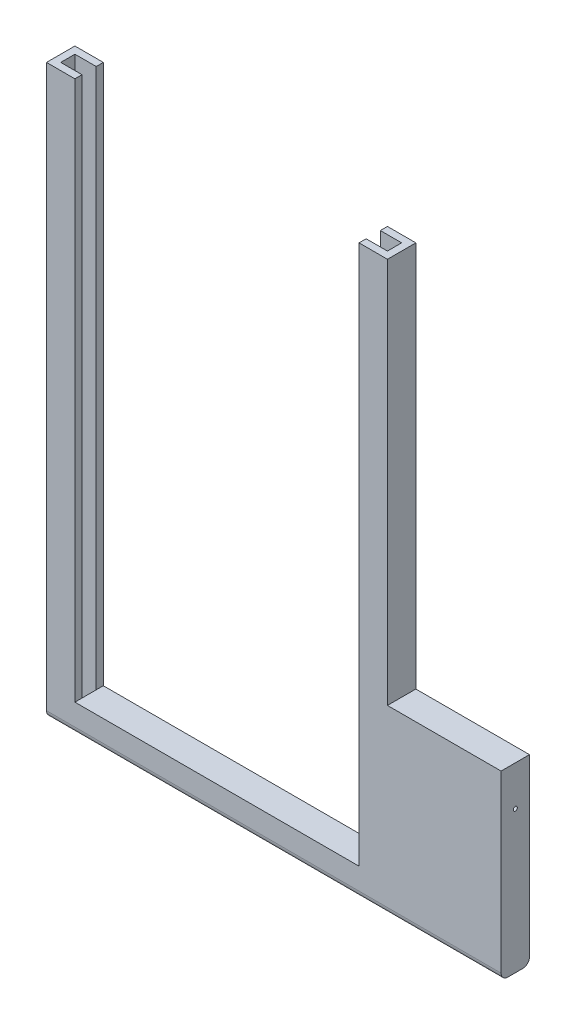
ISO-10303-21;
HEADER;
FILE_DESCRIPTION(('STEP AP214'),'2;1');
FILE_NAME('part.step','',(''),(''),'','','');
FILE_SCHEMA(('AUTOMOTIVE_DESIGN { 1 0 10303 214 1 1 1 1 }'));
ENDSEC;
DATA;
#1=APPLICATION_CONTEXT('core data for automotive mechanical design processes');
#2=APPLICATION_PROTOCOL_DEFINITION('international standard','automotive_design',2000,#1);
#3=PRODUCT_CONTEXT('',#1,'mechanical');
#4=PRODUCT('Part','Part','',(#3));
#5=PRODUCT_RELATED_PRODUCT_CATEGORY('part','',(#4));
#6=PRODUCT_DEFINITION_FORMATION('','',#4);
#7=PRODUCT_DEFINITION_CONTEXT('part definition',#1,'design');
#8=PRODUCT_DEFINITION('design','',#6,#7);
#9=PRODUCT_DEFINITION_SHAPE('','',#8);
#10=(LENGTH_UNIT() NAMED_UNIT(*) SI_UNIT(.MILLI.,.METRE.));
#11=(NAMED_UNIT(*) PLANE_ANGLE_UNIT() SI_UNIT($,.RADIAN.));
#12=(NAMED_UNIT(*) SI_UNIT($,.STERADIAN.) SOLID_ANGLE_UNIT());
#13=UNCERTAINTY_MEASURE_WITH_UNIT(LENGTH_MEASURE(1.E-05),#10,'distance_accuracy_value','');
#14=(GEOMETRIC_REPRESENTATION_CONTEXT(3) GLOBAL_UNCERTAINTY_ASSIGNED_CONTEXT((#13)) GLOBAL_UNIT_ASSIGNED_CONTEXT((#10,
#11,#12)) REPRESENTATION_CONTEXT('',''));
#15=CARTESIAN_POINT('',(0.,0.,0.));
#16=DIRECTION('',(0.,0.,1.));
#17=DIRECTION('',(1.,0.,0.));
#18=AXIS2_PLACEMENT_3D('',#15,#16,#17);
#19=CARTESIAN_POINT('',(55.,4.99999999999999,5.));
#20=DIRECTION('',(1.,0.,0.));
#21=DIRECTION('',(0.,0.,-1.));
#22=AXIS2_PLACEMENT_3D('',#19,#20,#21);
#23=PLANE('',#22);
#24=DIRECTION('',(0.,0.,-1.));
#25=VECTOR('',#24,1.);
#26=CARTESIAN_POINT('',(55.,100.,5.));
#27=LINE('',#26,#25);
#28=CARTESIAN_POINT('',(55.,100.,5.));
#29=VERTEX_POINT('',#28);
#30=CARTESIAN_POINT('',(55.,100.,3.75));
#31=VERTEX_POINT('',#30);
#32=EDGE_CURVE('E375',#29,#31,#27,.T.);
#33=ORIENTED_EDGE('',*,*,#32,.T.);
#34=DIRECTION('',(0.,1.,0.));
#35=VECTOR('',#34,1.);
#36=CARTESIAN_POINT('',(55.,0.,3.75));
#37=LINE('',#36,#35);
#38=CARTESIAN_POINT('',(55.,4.99999999999999,3.75));
#39=VERTEX_POINT('',#38);
#40=EDGE_CURVE('E238',#39,#31,#37,.T.);
#41=ORIENTED_EDGE('',*,*,#40,.F.);
#42=DIRECTION('',(0.,0.,-1.));
#43=VECTOR('',#42,1.);
#44=CARTESIAN_POINT('',(55.,4.99999999999999,5.));
#45=LINE('',#44,#43);
#46=CARTESIAN_POINT('',(55.,4.99999999999999,5.));
#47=VERTEX_POINT('',#46);
#48=EDGE_CURVE('E369',#47,#39,#45,.T.);
#49=ORIENTED_EDGE('',*,*,#48,.F.);
#50=DIRECTION('',(0.,-1.,0.));
#51=VECTOR('',#50,1.);
#52=CARTESIAN_POINT('',(55.,4.99999999999999,5.));
#53=LINE('',#52,#51);
#54=EDGE_CURVE('E304',#29,#47,#53,.T.);
#55=ORIENTED_EDGE('',*,*,#54,.F.);
#56=EDGE_LOOP('',(#33,#41,#49,#55));
#57=FACE_BOUND('',#56,.T.);
#58=ADVANCED_FACE('F39',(#57),#23,.F.);
#59=CARTESIAN_POINT('',(5.,100.,5.));
#60=DIRECTION('',(-1.,0.,0.));
#61=DIRECTION('',(0.,-1.,0.));
#62=AXIS2_PLACEMENT_3D('',#59,#60,#61);
#63=PLANE('',#62);
#64=DIRECTION('',(0.,0.,-1.));
#65=VECTOR('',#64,1.);
#66=CARTESIAN_POINT('',(5.00000000000001,4.99999999999999,5.));
#67=LINE('',#66,#65);
#68=CARTESIAN_POINT('',(5.00000000000001,4.99999999999999,5.));
#69=VERTEX_POINT('',#68);
#70=CARTESIAN_POINT('',(5.,4.99999999999999,3.75));
#71=VERTEX_POINT('',#70);
#72=EDGE_CURVE('E364',#69,#71,#67,.T.);
#73=ORIENTED_EDGE('',*,*,#72,.T.);
#74=DIRECTION('',(0.,1.,0.));
#75=VECTOR('',#74,1.);
#76=CARTESIAN_POINT('',(5.,0.,3.75));
#77=LINE('',#76,#75);
#78=CARTESIAN_POINT('',(5.,100.,3.75));
#79=VERTEX_POINT('',#78);
#80=EDGE_CURVE('E262',#71,#79,#77,.T.);
#81=ORIENTED_EDGE('',*,*,#80,.T.);
#82=DIRECTION('',(0.,0.,-1.));
#83=VECTOR('',#82,1.);
#84=CARTESIAN_POINT('',(5.,100.,5.));
#85=LINE('',#84,#83);
#86=CARTESIAN_POINT('',(5.,100.,5.));
#87=VERTEX_POINT('',#86);
#88=EDGE_CURVE('E359',#87,#79,#85,.T.);
#89=ORIENTED_EDGE('',*,*,#88,.F.);
#90=DIRECTION('',(0.,1.,0.));
#91=VECTOR('',#90,1.);
#92=CARTESIAN_POINT('',(5.,100.,5.));
#93=LINE('',#92,#91);
#94=EDGE_CURVE('E310',#69,#87,#93,.T.);
#95=ORIENTED_EDGE('',*,*,#94,.F.);
#96=EDGE_LOOP('',(#73,#81,#89,#95));
#97=FACE_BOUND('',#96,.T.);
#98=ADVANCED_FACE('F515',(#97),#63,.F.);
#99=CARTESIAN_POINT('',(80.,0.,5.));
#100=DIRECTION('',(0.,1.,0.));
#101=DIRECTION('',(-1.,0.,0.));
#102=AXIS2_PLACEMENT_3D('',#99,#100,#101);
#103=PLANE('',#102);
#104=DIRECTION('',(0.,0.,1.));
#105=VECTOR('',#104,1.);
#106=CARTESIAN_POINT('',(55.,0.,3.75));
#107=LINE('',#106,#105);
#108=CARTESIAN_POINT('',(55.,0.,1.25));
#109=VERTEX_POINT('',#108);
#110=CARTESIAN_POINT('',(55.,0.,3.75));
#111=VERTEX_POINT('',#110);
#112=EDGE_CURVE('E201',#109,#111,#107,.T.);
#113=ORIENTED_EDGE('',*,*,#112,.T.);
#114=DIRECTION('',(1.,0.,0.));
#115=VECTOR('',#114,1.);
#116=CARTESIAN_POINT('',(58.75,0.,3.75));
#117=LINE('',#116,#115);
#118=CARTESIAN_POINT('',(58.75,0.,3.75));
#119=VERTEX_POINT('',#118);
#120=EDGE_CURVE('E192',#111,#119,#117,.T.);
#121=ORIENTED_EDGE('',*,*,#120,.T.);
#122=DIRECTION('',(0.,0.,-1.));
#123=VECTOR('',#122,1.);
#124=CARTESIAN_POINT('',(58.75,0.,1.25));
#125=LINE('',#124,#123);
#126=CARTESIAN_POINT('',(58.75,0.,1.25));
#127=VERTEX_POINT('',#126);
#128=EDGE_CURVE('E205',#119,#127,#125,.T.);
#129=ORIENTED_EDGE('',*,*,#128,.T.);
#130=DIRECTION('',(-1.,0.,0.));
#131=VECTOR('',#130,1.);
#132=CARTESIAN_POINT('',(55.,0.,1.25));
#133=LINE('',#132,#131);
#134=EDGE_CURVE('E210',#127,#109,#133,.T.);
#135=ORIENTED_EDGE('',*,*,#134,.T.);
#136=EDGE_LOOP('',(#113,#121,#129,#135));
#137=FACE_BOUND('',#136,.T.);
#138=DIRECTION('',(0.,0.,1.));
#139=VECTOR('',#138,1.);
#140=CARTESIAN_POINT('',(1.25,0.,1.25));
#141=LINE('',#140,#139);
#142=CARTESIAN_POINT('',(1.25,0.,1.25));
#143=VERTEX_POINT('',#142);
#144=CARTESIAN_POINT('',(1.25,0.,3.75));
#145=VERTEX_POINT('',#144);
#146=EDGE_CURVE('E258',#143,#145,#141,.T.);
#147=ORIENTED_EDGE('',*,*,#146,.T.);
#148=DIRECTION('',(1.,0.,0.));
#149=VECTOR('',#148,1.);
#150=CARTESIAN_POINT('',(1.25,0.,3.75));
#151=LINE('',#150,#149);
#152=CARTESIAN_POINT('',(5.,0.,3.75));
#153=VERTEX_POINT('',#152);
#154=EDGE_CURVE('E245',#145,#153,#151,.T.);
#155=ORIENTED_EDGE('',*,*,#154,.T.);
#156=DIRECTION('',(0.,0.,-1.));
#157=VECTOR('',#156,1.);
#158=CARTESIAN_POINT('',(5.,0.,3.75));
#159=LINE('',#158,#157);
#160=CARTESIAN_POINT('',(5.,0.,1.25));
#161=VERTEX_POINT('',#160);
#162=EDGE_CURVE('E249',#153,#161,#159,.T.);
#163=ORIENTED_EDGE('',*,*,#162,.T.);
#164=DIRECTION('',(-1.,0.,0.));
#165=VECTOR('',#164,1.);
#166=CARTESIAN_POINT('',(5.,0.,1.25));
#167=LINE('',#166,#165);
#168=EDGE_CURVE('E254',#161,#143,#167,.T.);
#169=ORIENTED_EDGE('',*,*,#168,.T.);
#170=EDGE_LOOP('',(#147,#155,#163,#169));
#171=FACE_BOUND('',#170,.T.);
#172=DIRECTION('',(0.,0.,-1.));
#173=VECTOR('',#172,1.);
#174=CARTESIAN_POINT('',(80.,0.,5.));
#175=LINE('',#174,#173);
#176=CARTESIAN_POINT('',(80.,0.,3.8));
#177=VERTEX_POINT('',#176);
#178=CARTESIAN_POINT('',(80.,0.,1.2));
#179=VERTEX_POINT('',#178);
#180=EDGE_CURVE('E391',#177,#179,#175,.T.);
#181=ORIENTED_EDGE('',*,*,#180,.F.);
#182=DIRECTION('',(1.,0.,0.));
#183=VECTOR('',#182,1.);
#184=CARTESIAN_POINT('',(80.,0.,3.8));
#185=LINE('',#184,#183);
#186=CARTESIAN_POINT('',(0.,0.,3.8));
#187=VERTEX_POINT('',#186);
#188=EDGE_CURVE('E48',#177,#187,#185,.F.);
#189=ORIENTED_EDGE('',*,*,#188,.T.);
#190=DIRECTION('',(0.,0.,-1.));
#191=VECTOR('',#190,1.);
#192=CARTESIAN_POINT('',(0.,0.,5.));
#193=LINE('',#192,#191);
#194=CARTESIAN_POINT('',(0.,0.,1.2));
#195=VERTEX_POINT('',#194);
#196=EDGE_CURVE('E320',#187,#195,#193,.T.);
#197=ORIENTED_EDGE('',*,*,#196,.T.);
#198=DIRECTION('',(1.,0.,0.));
#199=VECTOR('',#198,1.);
#200=CARTESIAN_POINT('',(80.,0.,1.2));
#201=LINE('',#200,#199);
#202=EDGE_CURVE('E394',#195,#179,#201,.T.);
#203=ORIENTED_EDGE('',*,*,#202,.T.);
#204=EDGE_LOOP('',(#181,#189,#197,#203));
#205=FACE_BOUND('',#204,.T.);
#206=ADVANCED_FACE('F212',(#137,#171,#205),#103,.F.);
#207=CARTESIAN_POINT('',(80.,32.,5.));
#208=DIRECTION('',(-1.,0.,0.));
#209=DIRECTION('',(0.,0.,1.));
#210=AXIS2_PLACEMENT_3D('',#207,#208,#209);
#211=PLANE('',#210);
#212=CARTESIAN_POINT('',(80.,25.,2.5));
#213=DIRECTION('',(1.,0.,0.));
#214=DIRECTION('',(0.,0.,-1.));
#215=AXIS2_PLACEMENT_3D('',#212,#213,#214);
#216=CIRCLE('',#215,0.36);
#217=CARTESIAN_POINT('',(80.,25.,2.14));
#218=VERTEX_POINT('',#217);
#219=EDGE_CURVE('E500',#218,#218,#216,.T.);
#220=ORIENTED_EDGE('',*,*,#219,.F.);
#221=EDGE_LOOP('',(#220));
#222=FACE_BOUND('',#221,.T.);
#223=DIRECTION('',(0.,1.,0.));
#224=VECTOR('',#223,1.);
#225=CARTESIAN_POINT('',(80.,32.,5.));
#226=LINE('',#225,#224);
#227=CARTESIAN_POINT('',(80.,1.2,5.));
#228=VERTEX_POINT('',#227);
#229=CARTESIAN_POINT('',(80.,32.,5.));
#230=VERTEX_POINT('',#229);
#231=EDGE_CURVE('E291',#228,#230,#226,.T.);
#232=ORIENTED_EDGE('',*,*,#231,.F.);
#233=CARTESIAN_POINT('',(80.,1.2,3.8));
#234=DIRECTION('',(-1.,0.,0.));
#235=DIRECTION('',(0.,0.,1.));
#236=AXIS2_PLACEMENT_3D('',#233,#234,#235);
#237=CIRCLE('',#236,1.2);
#238=EDGE_CURVE('E62',#228,#177,#237,.F.);
#239=ORIENTED_EDGE('',*,*,#238,.T.);
#240=ORIENTED_EDGE('',*,*,#180,.T.);
#241=CARTESIAN_POINT('',(80.,1.2,1.2));
#242=DIRECTION('',(-1.,0.,0.));
#243=DIRECTION('',(0.,0.,1.));
#244=AXIS2_PLACEMENT_3D('',#241,#242,#243);
#245=CIRCLE('',#244,1.2);
#246=CARTESIAN_POINT('',(80.,1.2,0.));
#247=VERTEX_POINT('',#246);
#248=EDGE_CURVE('E403',#179,#247,#245,.F.);
#249=ORIENTED_EDGE('',*,*,#248,.T.);
#250=DIRECTION('',(0.,1.,0.));
#251=VECTOR('',#250,1.);
#252=CARTESIAN_POINT('',(80.,32.,0.));
#253=LINE('',#252,#251);
#254=CARTESIAN_POINT('',(80.,32.,0.));
#255=VERTEX_POINT('',#254);
#256=EDGE_CURVE('E290',#247,#255,#253,.T.);
#257=ORIENTED_EDGE('',*,*,#256,.T.);
#258=DIRECTION('',(0.,0.,-1.));
#259=VECTOR('',#258,1.);
#260=CARTESIAN_POINT('',(80.,32.,5.));
#261=LINE('',#260,#259);
#262=EDGE_CURVE('E387',#230,#255,#261,.T.);
#263=ORIENTED_EDGE('',*,*,#262,.F.);
#264=EDGE_LOOP('',(#232,#239,#240,#249,#257,#263));
#265=FACE_BOUND('',#264,.T.);
#266=ADVANCED_FACE('F469',(#222,#265),#211,.F.);
#267=CARTESIAN_POINT('',(60.,32.,5.));
#268=DIRECTION('',(0.,-1.,0.));
#269=DIRECTION('',(0.,0.,-1.));
#270=AXIS2_PLACEMENT_3D('',#267,#268,#269);
#271=PLANE('',#270);
#272=DIRECTION('',(-1.,0.,0.));
#273=VECTOR('',#272,1.);
#274=CARTESIAN_POINT('',(60.,32.,0.));
#275=LINE('',#274,#273);
#276=CARTESIAN_POINT('',(60.,32.,0.));
#277=VERTEX_POINT('',#276);
#278=EDGE_CURVE('E323',#255,#277,#275,.T.);
#279=ORIENTED_EDGE('',*,*,#278,.T.);
#280=DIRECTION('',(0.,0.,-1.));
#281=VECTOR('',#280,1.);
#282=CARTESIAN_POINT('',(60.,32.,5.));
#283=LINE('',#282,#281);
#284=CARTESIAN_POINT('',(60.,32.,5.));
#285=VERTEX_POINT('',#284);
#286=EDGE_CURVE('E383',#285,#277,#283,.T.);
#287=ORIENTED_EDGE('',*,*,#286,.F.);
#288=DIRECTION('',(-1.,0.,0.));
#289=VECTOR('',#288,1.);
#290=CARTESIAN_POINT('',(60.,32.,5.));
#291=LINE('',#290,#289);
#292=EDGE_CURVE('E294',#230,#285,#291,.T.);
#293=ORIENTED_EDGE('',*,*,#292,.F.);
#294=ORIENTED_EDGE('',*,*,#262,.T.);
#295=EDGE_LOOP('',(#279,#287,#293,#294));
#296=FACE_BOUND('',#295,.T.);
#297=ADVANCED_FACE('F467',(#296),#271,.F.);
#298=CARTESIAN_POINT('',(60.,50.,5.));
#299=DIRECTION('',(-1.,0.,0.));
#300=DIRECTION('',(0.,-1.,0.));
#301=AXIS2_PLACEMENT_3D('',#298,#299,#300);
#302=PLANE('',#301);
#303=DIRECTION('',(0.,1.,0.));
#304=VECTOR('',#303,1.);
#305=CARTESIAN_POINT('',(60.,50.,0.));
#306=LINE('',#305,#304);
#307=CARTESIAN_POINT('',(60.,100.,0.));
#308=VERTEX_POINT('',#307);
#309=EDGE_CURVE('E327',#277,#308,#306,.T.);
#310=ORIENTED_EDGE('',*,*,#309,.T.);
#311=DIRECTION('',(0.,0.,-1.));
#312=VECTOR('',#311,1.);
#313=CARTESIAN_POINT('',(60.,100.,5.));
#314=LINE('',#313,#312);
#315=CARTESIAN_POINT('',(60.,100.,5.));
#316=VERTEX_POINT('',#315);
#317=EDGE_CURVE('E379',#316,#308,#314,.T.);
#318=ORIENTED_EDGE('',*,*,#317,.F.);
#319=DIRECTION('',(0.,1.,0.));
#320=VECTOR('',#319,1.);
#321=CARTESIAN_POINT('',(60.,50.,5.));
#322=LINE('',#321,#320);
#323=EDGE_CURVE('E298',#285,#316,#322,.T.);
#324=ORIENTED_EDGE('',*,*,#323,.F.);
#325=ORIENTED_EDGE('',*,*,#286,.T.);
#326=EDGE_LOOP('',(#310,#318,#324,#325));
#327=FACE_BOUND('',#326,.T.);
#328=ADVANCED_FACE('F464',(#327),#302,.F.);
#329=CARTESIAN_POINT('',(55.,100.,5.));
#330=DIRECTION('',(0.,-1.,0.));
#331=DIRECTION('',(0.,0.,-1.));
#332=AXIS2_PLACEMENT_3D('',#329,#330,#331);
#333=PLANE('',#332);
#334=DIRECTION('',(0.,0.,-1.));
#335=VECTOR('',#334,1.);
#336=CARTESIAN_POINT('',(58.75,100.,1.25));
#337=LINE('',#336,#335);
#338=CARTESIAN_POINT('',(58.75,100.,3.75));
#339=VERTEX_POINT('',#338);
#340=CARTESIAN_POINT('',(58.75,100.,1.25));
#341=VERTEX_POINT('',#340);
#342=EDGE_CURVE('E219',#339,#341,#337,.T.);
#343=ORIENTED_EDGE('',*,*,#342,.F.);
#344=DIRECTION('',(1.,0.,0.));
#345=VECTOR('',#344,1.);
#346=CARTESIAN_POINT('',(58.75,100.,3.75));
#347=LINE('',#346,#345);
#348=EDGE_CURVE('E195',#31,#339,#347,.T.);
#349=ORIENTED_EDGE('',*,*,#348,.F.);
#350=ORIENTED_EDGE('',*,*,#32,.F.);
#351=DIRECTION('',(-1.,0.,0.));
#352=VECTOR('',#351,1.);
#353=CARTESIAN_POINT('',(55.,100.,5.));
#354=LINE('',#353,#352);
#355=EDGE_CURVE('E301',#316,#29,#354,.T.);
#356=ORIENTED_EDGE('',*,*,#355,.F.);
#357=ORIENTED_EDGE('',*,*,#317,.T.);
#358=DIRECTION('',(-1.,0.,0.));
#359=VECTOR('',#358,1.);
#360=CARTESIAN_POINT('',(55.,100.,0.));
#361=LINE('',#360,#359);
#362=CARTESIAN_POINT('',(55.,100.,0.));
#363=VERTEX_POINT('',#362);
#364=EDGE_CURVE('E330',#308,#363,#361,.T.);
#365=ORIENTED_EDGE('',*,*,#364,.T.);
#366=CARTESIAN_POINT('',(55.,100.,1.25));
#367=VERTEX_POINT('',#366);
#368=EDGE_CURVE('E373',#367,#363,#27,.T.);
#369=ORIENTED_EDGE('',*,*,#368,.F.);
#370=DIRECTION('',(-1.,0.,0.));
#371=VECTOR('',#370,1.);
#372=CARTESIAN_POINT('',(55.,100.,1.25));
#373=LINE('',#372,#371);
#374=EDGE_CURVE('E216',#341,#367,#373,.T.);
#375=ORIENTED_EDGE('',*,*,#374,.F.);
#376=EDGE_LOOP('',(#343,#349,#350,#356,#357,#365,#369,#375));
#377=FACE_BOUND('',#376,.T.);
#378=ADVANCED_FACE('F436',(#377),#333,.F.);
#379=CARTESIAN_POINT('',(55.,4.99999999999999,1.25));
#380=VERTEX_POINT('',#379);
#381=CARTESIAN_POINT('',(55.,4.99999999999999,0.));
#382=VERTEX_POINT('',#381);
#383=EDGE_CURVE('E368',#380,#382,#45,.T.);
#384=ORIENTED_EDGE('',*,*,#383,.F.);
#385=DIRECTION('',(0.,1.,0.));
#386=VECTOR('',#385,1.);
#387=CARTESIAN_POINT('',(55.,0.,1.25));
#388=LINE('',#387,#386);
#389=EDGE_CURVE('E242',#380,#367,#388,.T.);
#390=ORIENTED_EDGE('',*,*,#389,.T.);
#391=ORIENTED_EDGE('',*,*,#368,.T.);
#392=DIRECTION('',(0.,-1.,0.));
#393=VECTOR('',#392,1.);
#394=CARTESIAN_POINT('',(55.,4.99999999999999,0.));
#395=LINE('',#394,#393);
#396=EDGE_CURVE('E334',#363,#382,#395,.T.);
#397=ORIENTED_EDGE('',*,*,#396,.T.);
#398=EDGE_LOOP('',(#384,#390,#391,#397));
#399=FACE_BOUND('',#398,.T.);
#400=ADVANCED_FACE('F432',(#399),#23,.F.);
#401=CARTESIAN_POINT('',(5.00000000000001,4.99999999999999,5.));
#402=DIRECTION('',(0.,-1.,0.));
#403=DIRECTION('',(1.,0.,0.));
#404=AXIS2_PLACEMENT_3D('',#401,#402,#403);
#405=PLANE('',#404);
#406=DIRECTION('',(-1.,0.,0.));
#407=VECTOR('',#406,1.);
#408=CARTESIAN_POINT('',(5.00000000000001,4.99999999999999,0.));
#409=LINE('',#408,#407);
#410=CARTESIAN_POINT('',(5.00000000000001,4.99999999999999,0.));
#411=VERTEX_POINT('',#410);
#412=EDGE_CURVE('E338',#382,#411,#409,.T.);
#413=ORIENTED_EDGE('',*,*,#412,.T.);
#414=CARTESIAN_POINT('',(5.,4.99999999999999,1.25));
#415=VERTEX_POINT('',#414);
#416=EDGE_CURVE('E363',#415,#411,#67,.T.);
#417=ORIENTED_EDGE('',*,*,#416,.F.);
#418=DIRECTION('',(0.,0.,1.));
#419=VECTOR('',#418,1.);
#420=CARTESIAN_POINT('',(5.00000000000001,4.99999999999999,5.));
#421=LINE('',#420,#419);
#422=EDGE_CURVE('E237',#415,#71,#421,.T.);
#423=ORIENTED_EDGE('',*,*,#422,.T.);
#424=ORIENTED_EDGE('',*,*,#72,.F.);
#425=DIRECTION('',(-1.,0.,0.));
#426=VECTOR('',#425,1.);
#427=CARTESIAN_POINT('',(5.00000000000001,4.99999999999999,5.));
#428=LINE('',#427,#426);
#429=EDGE_CURVE('E307',#47,#69,#428,.T.);
#430=ORIENTED_EDGE('',*,*,#429,.F.);
#431=ORIENTED_EDGE('',*,*,#48,.T.);
#432=EDGE_CURVE('E374',#39,#380,#45,.T.);
#433=ORIENTED_EDGE('',*,*,#432,.T.);
#434=ORIENTED_EDGE('',*,*,#383,.T.);
#435=EDGE_LOOP('',(#413,#417,#423,#424,#430,#431,#433,#434));
#436=FACE_BOUND('',#435,.T.);
#437=ADVANCED_FACE('F449',(#436),#405,.F.);
#438=CARTESIAN_POINT('',(5.,100.,1.25));
#439=VERTEX_POINT('',#438);
#440=CARTESIAN_POINT('',(5.,100.,0.));
#441=VERTEX_POINT('',#440);
#442=EDGE_CURVE('E358',#439,#441,#85,.T.);
#443=ORIENTED_EDGE('',*,*,#442,.F.);
#444=DIRECTION('',(0.,1.,0.));
#445=VECTOR('',#444,1.);
#446=CARTESIAN_POINT('',(5.,0.,1.25));
#447=LINE('',#446,#445);
#448=EDGE_CURVE('E282',#415,#439,#447,.T.);
#449=ORIENTED_EDGE('',*,*,#448,.F.);
#450=ORIENTED_EDGE('',*,*,#416,.T.);
#451=DIRECTION('',(0.,1.,0.));
#452=VECTOR('',#451,1.);
#453=CARTESIAN_POINT('',(5.,100.,0.));
#454=LINE('',#453,#452);
#455=EDGE_CURVE('E342',#411,#441,#454,.T.);
#456=ORIENTED_EDGE('',*,*,#455,.T.);
#457=EDGE_LOOP('',(#443,#449,#450,#456));
#458=FACE_BOUND('',#457,.T.);
#459=ADVANCED_FACE('F490',(#458),#63,.F.);
#460=CARTESIAN_POINT('',(0.,100.,5.));
#461=DIRECTION('',(0.,-1.,0.));
#462=DIRECTION('',(0.,0.,-1.));
#463=AXIS2_PLACEMENT_3D('',#460,#461,#462);
#464=PLANE('',#463);
#465=ORIENTED_EDGE('',*,*,#88,.T.);
#466=DIRECTION('',(1.,0.,0.));
#467=VECTOR('',#466,1.);
#468=CARTESIAN_POINT('',(1.25,100.,3.75));
#469=LINE('',#468,#467);
#470=CARTESIAN_POINT('',(1.25,100.,3.75));
#471=VERTEX_POINT('',#470);
#472=EDGE_CURVE('E263',#471,#79,#469,.T.);
#473=ORIENTED_EDGE('',*,*,#472,.F.);
#474=DIRECTION('',(0.,0.,1.));
#475=VECTOR('',#474,1.);
#476=CARTESIAN_POINT('',(1.25,100.,1.25));
#477=LINE('',#476,#475);
#478=CARTESIAN_POINT('',(1.25,100.,1.25));
#479=VERTEX_POINT('',#478);
#480=EDGE_CURVE('E250',#479,#471,#477,.T.);
#481=ORIENTED_EDGE('',*,*,#480,.F.);
#482=DIRECTION('',(-1.,0.,0.));
#483=VECTOR('',#482,1.);
#484=CARTESIAN_POINT('',(5.,100.,1.25));
#485=LINE('',#484,#483);
#486=EDGE_CURVE('E266',#439,#479,#485,.T.);
#487=ORIENTED_EDGE('',*,*,#486,.F.);
#488=ORIENTED_EDGE('',*,*,#442,.T.);
#489=DIRECTION('',(-1.,0.,0.));
#490=VECTOR('',#489,1.);
#491=CARTESIAN_POINT('',(0.,100.,0.));
#492=LINE('',#491,#490);
#493=CARTESIAN_POINT('',(0.,100.,0.));
#494=VERTEX_POINT('',#493);
#495=EDGE_CURVE('E346',#441,#494,#492,.T.);
#496=ORIENTED_EDGE('',*,*,#495,.T.);
#497=DIRECTION('',(0.,0.,-1.));
#498=VECTOR('',#497,1.);
#499=CARTESIAN_POINT('',(0.,100.,5.));
#500=LINE('',#499,#498);
#501=CARTESIAN_POINT('',(0.,100.,5.));
#502=VERTEX_POINT('',#501);
#503=EDGE_CURVE('E354',#502,#494,#500,.T.);
#504=ORIENTED_EDGE('',*,*,#503,.F.);
#505=DIRECTION('',(-1.,0.,0.));
#506=VECTOR('',#505,1.);
#507=CARTESIAN_POINT('',(0.,100.,5.));
#508=LINE('',#507,#506);
#509=EDGE_CURVE('E313',#87,#502,#508,.T.);
#510=ORIENTED_EDGE('',*,*,#509,.F.);
#511=EDGE_LOOP('',(#465,#473,#481,#487,#488,#496,#504,#510));
#512=FACE_BOUND('',#511,.T.);
#513=ADVANCED_FACE('F483',(#512),#464,.F.);
#514=CARTESIAN_POINT('',(0.,0.,5.));
#515=DIRECTION('',(1.,0.,0.));
#516=DIRECTION('',(0.,0.,-1.));
#517=AXIS2_PLACEMENT_3D('',#514,#515,#516);
#518=PLANE('',#517);
#519=CARTESIAN_POINT('',(0.,25.,2.5));
#520=DIRECTION('',(1.,0.,0.));
#521=DIRECTION('',(0.,0.,-1.));
#522=AXIS2_PLACEMENT_3D('',#519,#520,#521);
#523=CIRCLE('',#522,0.36);
#524=CARTESIAN_POINT('',(0.,25.,2.14));
#525=VERTEX_POINT('',#524);
#526=EDGE_CURVE('E399',#525,#525,#523,.T.);
#527=ORIENTED_EDGE('',*,*,#526,.T.);
#528=EDGE_LOOP('',(#527));
#529=FACE_BOUND('',#528,.T.);
#530=ORIENTED_EDGE('',*,*,#196,.F.);
#531=CARTESIAN_POINT('',(0.,1.2,3.8));
#532=DIRECTION('',(1.,0.,0.));
#533=DIRECTION('',(0.,0.,-1.));
#534=AXIS2_PLACEMENT_3D('',#531,#532,#533);
#535=CIRCLE('',#534,1.2);
#536=CARTESIAN_POINT('',(0.,1.2,5.));
#537=VERTEX_POINT('',#536);
#538=EDGE_CURVE('E11',#187,#537,#535,.F.);
#539=ORIENTED_EDGE('',*,*,#538,.T.);
#540=DIRECTION('',(0.,-1.,0.));
#541=VECTOR('',#540,1.);
#542=CARTESIAN_POINT('',(0.,0.,5.));
#543=LINE('',#542,#541);
#544=EDGE_CURVE('E316',#502,#537,#543,.T.);
#545=ORIENTED_EDGE('',*,*,#544,.F.);
#546=ORIENTED_EDGE('',*,*,#503,.T.);
#547=DIRECTION('',(0.,-1.,0.));
#548=VECTOR('',#547,1.);
#549=CARTESIAN_POINT('',(0.,0.,0.));
#550=LINE('',#549,#548);
#551=CARTESIAN_POINT('',(0.,1.2,0.));
#552=VERTEX_POINT('',#551);
#553=EDGE_CURVE('E295',#494,#552,#550,.T.);
#554=ORIENTED_EDGE('',*,*,#553,.T.);
#555=CARTESIAN_POINT('',(0.,1.2,1.2));
#556=DIRECTION('',(1.,0.,0.));
#557=DIRECTION('',(0.,0.,-1.));
#558=AXIS2_PLACEMENT_3D('',#555,#556,#557);
#559=CIRCLE('',#558,1.2);
#560=EDGE_CURVE('E409',#552,#195,#559,.F.);
#561=ORIENTED_EDGE('',*,*,#560,.T.);
#562=EDGE_LOOP('',(#530,#539,#545,#546,#554,#561));
#563=FACE_BOUND('',#562,.T.);
#564=ADVANCED_FACE('F478',(#529,#563),#518,.F.);
#565=CARTESIAN_POINT('',(0.,0.,5.));
#566=DIRECTION('',(0.,0.,-1.));
#567=DIRECTION('',(-1.,0.,0.));
#568=AXIS2_PLACEMENT_3D('',#565,#566,#567);
#569=PLANE('',#568);
#570=ORIENTED_EDGE('',*,*,#544,.T.);
#571=DIRECTION('',(1.,0.,0.));
#572=VECTOR('',#571,1.);
#573=CARTESIAN_POINT('',(0.,1.2,5.));
#574=LINE('',#573,#572);
#575=EDGE_CURVE('E413',#537,#228,#574,.T.);
#576=ORIENTED_EDGE('',*,*,#575,.T.);
#577=ORIENTED_EDGE('',*,*,#231,.T.);
#578=ORIENTED_EDGE('',*,*,#292,.T.);
#579=ORIENTED_EDGE('',*,*,#323,.T.);
#580=ORIENTED_EDGE('',*,*,#355,.T.);
#581=ORIENTED_EDGE('',*,*,#54,.T.);
#582=ORIENTED_EDGE('',*,*,#429,.T.);
#583=ORIENTED_EDGE('',*,*,#94,.T.);
#584=ORIENTED_EDGE('',*,*,#509,.T.);
#585=EDGE_LOOP('',(#570,#576,#577,#578,#579,#580,#581,#582,#583,#584));
#586=FACE_BOUND('',#585,.T.);
#587=ADVANCED_FACE('F459',(#586),#569,.F.);
#588=CARTESIAN_POINT('',(0.,0.,0.));
#589=DIRECTION('',(0.,0.,-1.));
#590=DIRECTION('',(-1.,0.,0.));
#591=AXIS2_PLACEMENT_3D('',#588,#589,#590);
#592=PLANE('',#591);
#593=ORIENTED_EDGE('',*,*,#256,.F.);
#594=DIRECTION('',(1.,0.,0.));
#595=VECTOR('',#594,1.);
#596=CARTESIAN_POINT('',(0.,1.2,0.));
#597=LINE('',#596,#595);
#598=EDGE_CURVE('E406',#247,#552,#597,.F.);
#599=ORIENTED_EDGE('',*,*,#598,.T.);
#600=ORIENTED_EDGE('',*,*,#553,.F.);
#601=ORIENTED_EDGE('',*,*,#495,.F.);
#602=ORIENTED_EDGE('',*,*,#455,.F.);
#603=ORIENTED_EDGE('',*,*,#412,.F.);
#604=ORIENTED_EDGE('',*,*,#396,.F.);
#605=ORIENTED_EDGE('',*,*,#364,.F.);
#606=ORIENTED_EDGE('',*,*,#309,.F.);
#607=ORIENTED_EDGE('',*,*,#278,.F.);
#608=EDGE_LOOP('',(#593,#599,#600,#601,#602,#603,#604,#605,#606,#607));
#609=FACE_BOUND('',#608,.T.);
#610=ADVANCED_FACE('F444',(#609),#592,.T.);
#611=CARTESIAN_POINT('',(5.,0.,3.75));
#612=DIRECTION('',(1.,0.,0.));
#613=DIRECTION('',(0.,0.,-1.));
#614=AXIS2_PLACEMENT_3D('',#611,#612,#613);
#615=PLANE('',#614);
#616=EDGE_CURVE('E278',#161,#415,#447,.T.);
#617=ORIENTED_EDGE('',*,*,#616,.F.);
#618=ORIENTED_EDGE('',*,*,#162,.F.);
#619=EDGE_CURVE('E283',#153,#71,#77,.T.);
#620=ORIENTED_EDGE('',*,*,#619,.T.);
#621=ORIENTED_EDGE('',*,*,#422,.F.);
#622=EDGE_LOOP('',(#617,#618,#620,#621));
#623=FACE_BOUND('',#622,.T.);
#624=ADVANCED_FACE('F604',(#623),#615,.F.);
#625=CARTESIAN_POINT('',(1.25,0.,3.75));
#626=DIRECTION('',(0.,0.,1.));
#627=DIRECTION('',(1.,0.,0.));
#628=AXIS2_PLACEMENT_3D('',#625,#626,#627);
#629=PLANE('',#628);
#630=ORIENTED_EDGE('',*,*,#472,.T.);
#631=ORIENTED_EDGE('',*,*,#80,.F.);
#632=ORIENTED_EDGE('',*,*,#619,.F.);
#633=ORIENTED_EDGE('',*,*,#154,.F.);
#634=DIRECTION('',(0.,1.,0.));
#635=VECTOR('',#634,1.);
#636=CARTESIAN_POINT('',(1.25,0.,3.75));
#637=LINE('',#636,#635);
#638=EDGE_CURVE('E231',#145,#471,#637,.T.);
#639=ORIENTED_EDGE('',*,*,#638,.T.);
#640=EDGE_LOOP('',(#630,#631,#632,#633,#639));
#641=FACE_BOUND('',#640,.T.);
#642=ADVANCED_FACE('F621',(#641),#629,.F.);
#643=CARTESIAN_POINT('',(1.25,0.,1.25));
#644=DIRECTION('',(-1.,0.,0.));
#645=DIRECTION('',(0.,0.,1.));
#646=AXIS2_PLACEMENT_3D('',#643,#644,#645);
#647=PLANE('',#646);
#648=CARTESIAN_POINT('',(1.25,25.,2.5));
#649=DIRECTION('',(-1.,0.,0.));
#650=DIRECTION('',(0.,0.,1.));
#651=AXIS2_PLACEMENT_3D('',#648,#649,#650);
#652=CIRCLE('',#651,0.36);
#653=CARTESIAN_POINT('',(1.25,25.,2.86));
#654=VERTEX_POINT('',#653);
#655=EDGE_CURVE('E222',#654,#654,#652,.T.);
#656=ORIENTED_EDGE('',*,*,#655,.T.);
#657=EDGE_LOOP('',(#656));
#658=FACE_BOUND('',#657,.T.);
#659=ORIENTED_EDGE('',*,*,#480,.T.);
#660=ORIENTED_EDGE('',*,*,#638,.F.);
#661=ORIENTED_EDGE('',*,*,#146,.F.);
#662=DIRECTION('',(0.,1.,0.));
#663=VECTOR('',#662,1.);
#664=CARTESIAN_POINT('',(1.25,0.,1.25));
#665=LINE('',#664,#663);
#666=EDGE_CURVE('E275',#143,#479,#665,.T.);
#667=ORIENTED_EDGE('',*,*,#666,.T.);
#668=EDGE_LOOP('',(#659,#660,#661,#667));
#669=FACE_BOUND('',#668,.T.);
#670=ADVANCED_FACE('F630',(#658,#669),#647,.F.);
#671=CARTESIAN_POINT('',(5.,0.,1.25));
#672=DIRECTION('',(0.,0.,-1.));
#673=DIRECTION('',(-1.,0.,0.));
#674=AXIS2_PLACEMENT_3D('',#671,#672,#673);
#675=PLANE('',#674);
#676=ORIENTED_EDGE('',*,*,#486,.T.);
#677=ORIENTED_EDGE('',*,*,#666,.F.);
#678=ORIENTED_EDGE('',*,*,#168,.F.);
#679=ORIENTED_EDGE('',*,*,#616,.T.);
#680=ORIENTED_EDGE('',*,*,#448,.T.);
#681=EDGE_LOOP('',(#676,#677,#678,#679,#680));
#682=FACE_BOUND('',#681,.T.);
#683=ADVANCED_FACE('F640',(#682),#675,.F.);
#684=CARTESIAN_POINT('',(55.,0.,3.75));
#685=DIRECTION('',(-1.,0.,0.));
#686=DIRECTION('',(0.,0.,1.));
#687=AXIS2_PLACEMENT_3D('',#684,#685,#686);
#688=PLANE('',#687);
#689=EDGE_CURVE('E234',#111,#39,#37,.T.);
#690=ORIENTED_EDGE('',*,*,#689,.F.);
#691=ORIENTED_EDGE('',*,*,#112,.F.);
#692=EDGE_CURVE('E239',#109,#380,#388,.T.);
#693=ORIENTED_EDGE('',*,*,#692,.T.);
#694=ORIENTED_EDGE('',*,*,#432,.F.);
#695=EDGE_LOOP('',(#690,#691,#693,#694));
#696=FACE_BOUND('',#695,.T.);
#697=ADVANCED_FACE('F453',(#696),#688,.F.);
#698=CARTESIAN_POINT('',(58.75,0.,3.75));
#699=DIRECTION('',(0.,0.,1.));
#700=DIRECTION('',(1.,0.,0.));
#701=AXIS2_PLACEMENT_3D('',#698,#699,#700);
#702=PLANE('',#701);
#703=ORIENTED_EDGE('',*,*,#348,.T.);
#704=DIRECTION('',(0.,1.,0.));
#705=VECTOR('',#704,1.);
#706=CARTESIAN_POINT('',(58.75,0.,3.75));
#707=LINE('',#706,#705);
#708=EDGE_CURVE('E187',#119,#339,#707,.T.);
#709=ORIENTED_EDGE('',*,*,#708,.F.);
#710=ORIENTED_EDGE('',*,*,#120,.F.);
#711=ORIENTED_EDGE('',*,*,#689,.T.);
#712=ORIENTED_EDGE('',*,*,#40,.T.);
#713=EDGE_LOOP('',(#703,#709,#710,#711,#712));
#714=FACE_BOUND('',#713,.T.);
#715=ADVANCED_FACE('F189',(#714),#702,.F.);
#716=CARTESIAN_POINT('',(55.,0.,1.25));
#717=DIRECTION('',(0.,0.,-1.));
#718=DIRECTION('',(-1.,0.,0.));
#719=AXIS2_PLACEMENT_3D('',#716,#717,#718);
#720=PLANE('',#719);
#721=ORIENTED_EDGE('',*,*,#374,.T.);
#722=ORIENTED_EDGE('',*,*,#389,.F.);
#723=ORIENTED_EDGE('',*,*,#692,.F.);
#724=ORIENTED_EDGE('',*,*,#134,.F.);
#725=DIRECTION('',(0.,1.,0.));
#726=VECTOR('',#725,1.);
#727=CARTESIAN_POINT('',(58.75,0.,1.25));
#728=LINE('',#727,#726);
#729=EDGE_CURVE('E200',#127,#341,#728,.T.);
#730=ORIENTED_EDGE('',*,*,#729,.T.);
#731=EDGE_LOOP('',(#721,#722,#723,#724,#730));
#732=FACE_BOUND('',#731,.T.);
#733=ADVANCED_FACE('F664',(#732),#720,.F.);
#734=CARTESIAN_POINT('',(58.75,0.,1.25));
#735=DIRECTION('',(1.,0.,0.));
#736=DIRECTION('',(0.,0.,-1.));
#737=AXIS2_PLACEMENT_3D('',#734,#735,#736);
#738=PLANE('',#737);
#739=CARTESIAN_POINT('',(58.75,25.,2.5));
#740=DIRECTION('',(1.,0.,0.));
#741=DIRECTION('',(0.,0.,-1.));
#742=AXIS2_PLACEMENT_3D('',#739,#740,#741);
#743=CIRCLE('',#742,0.36);
#744=CARTESIAN_POINT('',(58.75,25.,2.14));
#745=VERTEX_POINT('',#744);
#746=EDGE_CURVE('E395',#745,#745,#743,.T.);
#747=ORIENTED_EDGE('',*,*,#746,.T.);
#748=EDGE_LOOP('',(#747));
#749=FACE_BOUND('',#748,.T.);
#750=ORIENTED_EDGE('',*,*,#342,.T.);
#751=ORIENTED_EDGE('',*,*,#729,.F.);
#752=ORIENTED_EDGE('',*,*,#128,.F.);
#753=ORIENTED_EDGE('',*,*,#708,.T.);
#754=EDGE_LOOP('',(#750,#751,#752,#753));
#755=FACE_BOUND('',#754,.T.);
#756=ADVANCED_FACE('F206',(#749,#755),#738,.F.);
#757=CARTESIAN_POINT('',(0.,25.,2.5));
#758=DIRECTION('',(1.,0.,0.));
#759=DIRECTION('',(0.,0.,-1.));
#760=AXIS2_PLACEMENT_3D('',#757,#758,#759);
#761=CYLINDRICAL_SURFACE('',#760,0.36);
#762=ORIENTED_EDGE('',*,*,#219,.T.);
#763=EDGE_LOOP('',(#762));
#764=FACE_BOUND('',#763,.T.);
#765=ORIENTED_EDGE('',*,*,#746,.F.);
#766=EDGE_LOOP('',(#765));
#767=FACE_BOUND('',#766,.T.);
#768=ADVANCED_FACE('F505',(#764,#767),#761,.F.);
#769=ORIENTED_EDGE('',*,*,#526,.F.);
#770=EDGE_LOOP('',(#769));
#771=FACE_BOUND('',#770,.T.);
#772=ORIENTED_EDGE('',*,*,#655,.F.);
#773=EDGE_LOOP('',(#772));
#774=FACE_BOUND('',#773,.T.);
#775=ADVANCED_FACE('F685',(#771,#774),#761,.F.);
#776=CARTESIAN_POINT('',(80.,1.2,1.2));
#777=DIRECTION('',(-1.,0.,0.));
#778=DIRECTION('',(0.,-1.,0.));
#779=AXIS2_PLACEMENT_3D('',#776,#777,#778);
#780=CYLINDRICAL_SURFACE('',#779,1.2);
#781=ORIENTED_EDGE('',*,*,#560,.F.);
#782=ORIENTED_EDGE('',*,*,#598,.F.);
#783=ORIENTED_EDGE('',*,*,#248,.F.);
#784=ORIENTED_EDGE('',*,*,#202,.F.);
#785=EDGE_LOOP('',(#781,#782,#783,#784));
#786=FACE_BOUND('',#785,.T.);
#787=ADVANCED_FACE('F475',(#786),#780,.T.);
#788=CARTESIAN_POINT('',(0.,1.2,3.8));
#789=DIRECTION('',(1.,0.,0.));
#790=DIRECTION('',(0.,1.,0.));
#791=AXIS2_PLACEMENT_3D('',#788,#789,#790);
#792=CYLINDRICAL_SURFACE('',#791,1.2);
#793=ORIENTED_EDGE('',*,*,#538,.F.);
#794=ORIENTED_EDGE('',*,*,#188,.F.);
#795=ORIENTED_EDGE('',*,*,#238,.F.);
#796=ORIENTED_EDGE('',*,*,#575,.F.);
#797=EDGE_LOOP('',(#793,#794,#795,#796));
#798=FACE_BOUND('',#797,.T.);
#799=ADVANCED_FACE('F41',(#798),#792,.T.);
#800=CLOSED_SHELL('',(#58,#98,#206,#266,#297,#328,#378,#400,#437,#459,#513,#564,#587,#610,#624,
#642,#670,#683,#697,#715,#733,#756,#768,#775,#787,#799));
#801=MANIFOLD_SOLID_BREP('B2',#800);
#802=ADVANCED_BREP_SHAPE_REPRESENTATION('',(#18,#801),#14);
#803=SHAPE_DEFINITION_REPRESENTATION(#9,#802);
ENDSEC;
END-ISO-10303-21;
